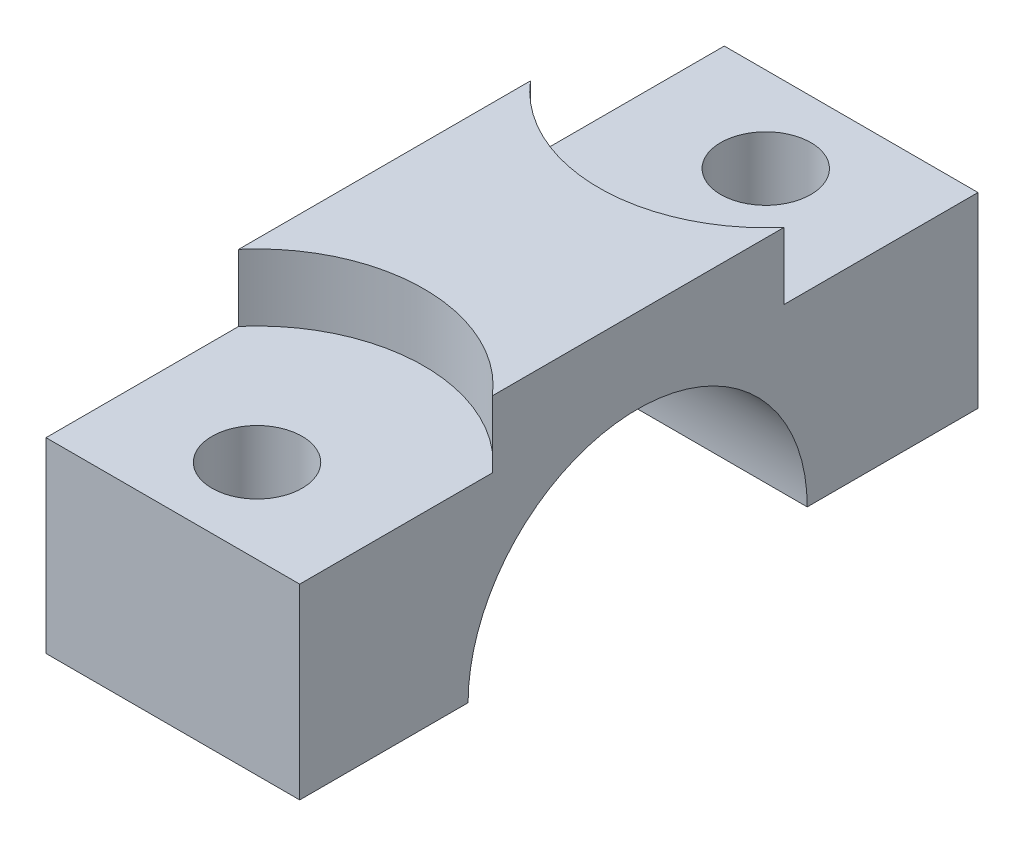
ISO-10303-21;
HEADER;
FILE_DESCRIPTION(('STEP AP214'),'2;1');
FILE_NAME('part.step','',(''),(''),'','','');
FILE_SCHEMA(('AUTOMOTIVE_DESIGN { 1 0 10303 214 1 1 1 1 }'));
ENDSEC;
DATA;
#1=APPLICATION_CONTEXT('core data for automotive mechanical design processes');
#2=APPLICATION_PROTOCOL_DEFINITION('international standard','automotive_design',2000,#1);
#3=PRODUCT_CONTEXT('',#1,'mechanical');
#4=PRODUCT('Part','Part','',(#3));
#5=PRODUCT_RELATED_PRODUCT_CATEGORY('part','',(#4));
#6=PRODUCT_DEFINITION_FORMATION('','',#4);
#7=PRODUCT_DEFINITION_CONTEXT('part definition',#1,'design');
#8=PRODUCT_DEFINITION('design','',#6,#7);
#9=PRODUCT_DEFINITION_SHAPE('','',#8);
#10=(LENGTH_UNIT() NAMED_UNIT(*) SI_UNIT(.MILLI.,.METRE.));
#11=(NAMED_UNIT(*) PLANE_ANGLE_UNIT() SI_UNIT($,.RADIAN.));
#12=(NAMED_UNIT(*) SI_UNIT($,.STERADIAN.) SOLID_ANGLE_UNIT());
#13=UNCERTAINTY_MEASURE_WITH_UNIT(LENGTH_MEASURE(1.E-05),#10,'distance_accuracy_value','');
#14=(GEOMETRIC_REPRESENTATION_CONTEXT(3) GLOBAL_UNCERTAINTY_ASSIGNED_CONTEXT((#13)) GLOBAL_UNIT_ASSIGNED_CONTEXT((#10,
#11,#12)) REPRESENTATION_CONTEXT('',''));
#15=CARTESIAN_POINT('',(0.,0.,0.));
#16=DIRECTION('',(0.,0.,1.));
#17=DIRECTION('',(1.,0.,0.));
#18=AXIS2_PLACEMENT_3D('',#15,#16,#17);
#19=CARTESIAN_POINT('',(19.,0.,0.));
#20=DIRECTION('',(-1.,0.,0.));
#21=DIRECTION('',(0.,0.,1.));
#22=AXIS2_PLACEMENT_3D('',#19,#20,#21);
#23=CYLINDRICAL_SURFACE('',#22,12.7);
#24=CARTESIAN_POINT('',(0.,0.,0.));
#25=DIRECTION('',(1.,0.,0.));
#26=DIRECTION('',(0.,0.,-1.));
#27=AXIS2_PLACEMENT_3D('',#24,#25,#26);
#28=CIRCLE('',#27,12.7);
#29=CARTESIAN_POINT('',(0.,0.,-12.7));
#30=VERTEX_POINT('',#29);
#31=CARTESIAN_POINT('',(0.,0.,12.7));
#32=VERTEX_POINT('',#31);
#33=EDGE_CURVE('E164',#30,#32,#28,.T.);
#34=ORIENTED_EDGE('',*,*,#33,.F.);
#35=DIRECTION('',(-1.,0.,0.));
#36=VECTOR('',#35,1.);
#37=CARTESIAN_POINT('',(19.,0.,-12.7));
#38=LINE('',#37,#36);
#39=CARTESIAN_POINT('',(19.,0.,-12.7));
#40=VERTEX_POINT('',#39);
#41=EDGE_CURVE('E211',#40,#30,#38,.T.);
#42=ORIENTED_EDGE('',*,*,#41,.F.);
#43=CARTESIAN_POINT('',(19.,0.,0.));
#44=DIRECTION('',(1.,0.,0.));
#45=DIRECTION('',(0.,0.,-1.));
#46=AXIS2_PLACEMENT_3D('',#43,#44,#45);
#47=CIRCLE('',#46,12.7);
#48=CARTESIAN_POINT('',(19.,0.,12.7));
#49=VERTEX_POINT('',#48);
#50=EDGE_CURVE('E165',#40,#49,#47,.T.);
#51=ORIENTED_EDGE('',*,*,#50,.T.);
#52=DIRECTION('',(-1.,0.,0.));
#53=VECTOR('',#52,1.);
#54=CARTESIAN_POINT('',(19.,0.,12.7));
#55=LINE('',#54,#53);
#56=EDGE_CURVE('E201',#49,#32,#55,.T.);
#57=ORIENTED_EDGE('',*,*,#56,.T.);
#58=EDGE_LOOP('',(#34,#42,#51,#57));
#59=FACE_BOUND('',#58,.T.);
#60=ADVANCED_FACE('F39',(#59),#23,.F.);
#61=CARTESIAN_POINT('',(19.,0.,0.));
#62=DIRECTION('',(0.,1.,0.));
#63=DIRECTION('',(0.,0.,1.));
#64=AXIS2_PLACEMENT_3D('',#61,#62,#63);
#65=PLANE('',#64);
#66=CARTESIAN_POINT('',(9.5,0.,-19.0947193806724));
#67=DIRECTION('',(0.,1.,0.));
#68=DIRECTION('',(0.,0.,1.));
#69=AXIS2_PLACEMENT_3D('',#66,#67,#68);
#70=CIRCLE('',#69,3.375);
#71=CARTESIAN_POINT('',(9.5,0.,-15.7197193806724));
#72=VERTEX_POINT('',#71);
#73=EDGE_CURVE('E226',#72,#72,#70,.T.);
#74=ORIENTED_EDGE('',*,*,#73,.T.);
#75=EDGE_LOOP('',(#74));
#76=FACE_BOUND('',#75,.T.);
#77=DIRECTION('',(0.,0.,-1.));
#78=VECTOR('',#77,1.);
#79=CARTESIAN_POINT('',(0.,0.,0.));
#80=LINE('',#79,#78);
#81=CARTESIAN_POINT('',(0.,0.,-25.4894387613447));
#82=VERTEX_POINT('',#81);
#83=EDGE_CURVE('E189',#30,#82,#80,.T.);
#84=ORIENTED_EDGE('',*,*,#83,.T.);
#85=DIRECTION('',(-1.,0.,0.));
#86=VECTOR('',#85,1.);
#87=CARTESIAN_POINT('',(19.,0.,-25.4894387613447));
#88=LINE('',#87,#86);
#89=CARTESIAN_POINT('',(19.,0.,-25.4894387613447));
#90=VERTEX_POINT('',#89);
#91=EDGE_CURVE('E207',#90,#82,#88,.T.);
#92=ORIENTED_EDGE('',*,*,#91,.F.);
#93=DIRECTION('',(0.,0.,-1.));
#94=VECTOR('',#93,1.);
#95=CARTESIAN_POINT('',(19.,0.,0.));
#96=LINE('',#95,#94);
#97=EDGE_CURVE('E169',#40,#90,#96,.T.);
#98=ORIENTED_EDGE('',*,*,#97,.F.);
#99=ORIENTED_EDGE('',*,*,#41,.T.);
#100=EDGE_LOOP('',(#84,#92,#98,#99));
#101=FACE_BOUND('',#100,.T.);
#102=ADVANCED_FACE('F232',(#76,#101),#65,.F.);
#103=CARTESIAN_POINT('',(19.,0.,-25.4894387613447));
#104=DIRECTION('',(0.,0.,1.));
#105=DIRECTION('',(1.,0.,0.));
#106=AXIS2_PLACEMENT_3D('',#103,#104,#105);
#107=PLANE('',#106);
#108=DIRECTION('',(0.,1.,0.));
#109=VECTOR('',#108,1.);
#110=CARTESIAN_POINT('',(0.,0.,-25.4894387613447));
#111=LINE('',#110,#109);
#112=CARTESIAN_POINT('',(0.,14.,-25.4894387613447));
#113=VERTEX_POINT('',#112);
#114=EDGE_CURVE('E192',#82,#113,#111,.T.);
#115=ORIENTED_EDGE('',*,*,#114,.T.);
#116=DIRECTION('',(1.,0.,0.));
#117=VECTOR('',#116,1.);
#118=CARTESIAN_POINT('',(19.,14.,-25.4894387613447));
#119=LINE('',#118,#117);
#120=CARTESIAN_POINT('',(19.,14.,-25.4894387613447));
#121=VERTEX_POINT('',#120);
#122=EDGE_CURVE('E116',#113,#121,#119,.T.);
#123=ORIENTED_EDGE('',*,*,#122,.T.);
#124=DIRECTION('',(0.,1.,0.));
#125=VECTOR('',#124,1.);
#126=CARTESIAN_POINT('',(19.,0.,-25.4894387613447));
#127=LINE('',#126,#125);
#128=EDGE_CURVE('E173',#90,#121,#127,.T.);
#129=ORIENTED_EDGE('',*,*,#128,.F.);
#130=ORIENTED_EDGE('',*,*,#91,.T.);
#131=EDGE_LOOP('',(#115,#123,#129,#130));
#132=FACE_BOUND('',#131,.T.);
#133=ADVANCED_FACE('F224',(#132),#107,.F.);
#134=CARTESIAN_POINT('',(19.,19.,0.));
#135=DIRECTION('',(0.,1.,0.));
#136=DIRECTION('',(0.,0.,1.));
#137=AXIS2_PLACEMENT_3D('',#134,#135,#136);
#138=PLANE('',#137);
#139=CARTESIAN_POINT('',(9.5,19.,-19.0947193806724));
#140=DIRECTION('',(0.,1.,0.));
#141=DIRECTION('',(0.,0.,1.));
#142=AXIS2_PLACEMENT_3D('',#139,#140,#141);
#143=CIRCLE('',#142,12.5);
#144=CARTESIAN_POINT('',(0.,19.,-10.9706809760364));
#145=VERTEX_POINT('',#144);
#146=CARTESIAN_POINT('',(19.,19.,-10.9706809760364));
#147=VERTEX_POINT('',#146);
#148=EDGE_CURVE('E131',#145,#147,#143,.T.);
#149=ORIENTED_EDGE('',*,*,#148,.F.);
#150=DIRECTION('',(0.,0.,-1.));
#151=VECTOR('',#150,1.);
#152=CARTESIAN_POINT('',(0.,19.,0.));
#153=LINE('',#152,#151);
#154=CARTESIAN_POINT('',(0.,19.,10.8812422146917));
#155=VERTEX_POINT('',#154);
#156=EDGE_CURVE('E136',#155,#145,#153,.T.);
#157=ORIENTED_EDGE('',*,*,#156,.F.);
#158=CARTESIAN_POINT('',(9.5,19.,19.0052806193276));
#159=DIRECTION('',(0.,1.,0.));
#160=DIRECTION('',(0.,0.,1.));
#161=AXIS2_PLACEMENT_3D('',#158,#159,#160);
#162=CIRCLE('',#161,12.5);
#163=CARTESIAN_POINT('',(19.,19.,10.8812422146917));
#164=VERTEX_POINT('',#163);
#165=EDGE_CURVE('E61',#164,#155,#162,.T.);
#166=ORIENTED_EDGE('',*,*,#165,.F.);
#167=DIRECTION('',(0.,0.,-1.));
#168=VECTOR('',#167,1.);
#169=CARTESIAN_POINT('',(19.,19.,0.));
#170=LINE('',#169,#168);
#171=EDGE_CURVE('E178',#164,#147,#170,.T.);
#172=ORIENTED_EDGE('',*,*,#171,.T.);
#173=EDGE_LOOP('',(#149,#157,#166,#172));
#174=FACE_BOUND('',#173,.T.);
#175=ADVANCED_FACE('F258',(#174),#138,.T.);
#176=CARTESIAN_POINT('',(19.,0.,25.3105612386553));
#177=DIRECTION('',(0.,0.,1.));
#178=DIRECTION('',(1.,0.,0.));
#179=AXIS2_PLACEMENT_3D('',#176,#177,#178);
#180=PLANE('',#179);
#181=DIRECTION('',(1.,0.,0.));
#182=VECTOR('',#181,1.);
#183=CARTESIAN_POINT('',(19.,14.,25.3105612386553));
#184=LINE('',#183,#182);
#185=CARTESIAN_POINT('',(0.,14.,25.3105612386553));
#186=VERTEX_POINT('',#185);
#187=CARTESIAN_POINT('',(19.,14.,25.3105612386553));
#188=VERTEX_POINT('',#187);
#189=EDGE_CURVE('E158',#186,#188,#184,.T.);
#190=ORIENTED_EDGE('',*,*,#189,.F.);
#191=DIRECTION('',(0.,1.,0.));
#192=VECTOR('',#191,1.);
#193=CARTESIAN_POINT('',(0.,0.,25.3105612386553));
#194=LINE('',#193,#192);
#195=CARTESIAN_POINT('',(0.,0.,25.3105612386553));
#196=VERTEX_POINT('',#195);
#197=EDGE_CURVE('E197',#196,#186,#194,.T.);
#198=ORIENTED_EDGE('',*,*,#197,.F.);
#199=DIRECTION('',(-1.,0.,0.));
#200=VECTOR('',#199,1.);
#201=CARTESIAN_POINT('',(19.,0.,25.3105612386553));
#202=LINE('',#201,#200);
#203=CARTESIAN_POINT('',(19.,0.,25.3105612386553));
#204=VERTEX_POINT('',#203);
#205=EDGE_CURVE('E204',#204,#196,#202,.T.);
#206=ORIENTED_EDGE('',*,*,#205,.F.);
#207=DIRECTION('',(0.,1.,0.));
#208=VECTOR('',#207,1.);
#209=CARTESIAN_POINT('',(19.,0.,25.3105612386553));
#210=LINE('',#209,#208);
#211=EDGE_CURVE('E182',#204,#188,#210,.T.);
#212=ORIENTED_EDGE('',*,*,#211,.T.);
#213=EDGE_LOOP('',(#190,#198,#206,#212));
#214=FACE_BOUND('',#213,.T.);
#215=ADVANCED_FACE('F250',(#214),#180,.T.);
#216=CARTESIAN_POINT('',(9.5,0.,19.0052806193276));
#217=DIRECTION('',(0.,1.,0.));
#218=DIRECTION('',(0.,0.,1.));
#219=AXIS2_PLACEMENT_3D('',#216,#217,#218);
#220=CIRCLE('',#219,3.375);
#221=CARTESIAN_POINT('',(9.5,0.,22.3802806193276));
#222=VERTEX_POINT('',#221);
#223=EDGE_CURVE('E151',#222,#222,#220,.T.);
#224=ORIENTED_EDGE('',*,*,#223,.T.);
#225=EDGE_LOOP('',(#224));
#226=FACE_BOUND('',#225,.T.);
#227=EDGE_CURVE('E170',#196,#32,#80,.T.);
#228=ORIENTED_EDGE('',*,*,#227,.T.);
#229=ORIENTED_EDGE('',*,*,#56,.F.);
#230=EDGE_CURVE('E174',#204,#49,#96,.T.);
#231=ORIENTED_EDGE('',*,*,#230,.F.);
#232=ORIENTED_EDGE('',*,*,#205,.T.);
#233=EDGE_LOOP('',(#228,#229,#231,#232));
#234=FACE_BOUND('',#233,.T.);
#235=ADVANCED_FACE('F241',(#226,#234),#65,.F.);
#236=CARTESIAN_POINT('',(19.,0.,0.));
#237=DIRECTION('',(1.,0.,0.));
#238=DIRECTION('',(0.,0.,-1.));
#239=AXIS2_PLACEMENT_3D('',#236,#237,#238);
#240=PLANE('',#239);
#241=DIRECTION('',(0.,1.,0.));
#242=VECTOR('',#241,1.);
#243=CARTESIAN_POINT('',(19.,19.,-10.9706809760364));
#244=LINE('',#243,#242);
#245=CARTESIAN_POINT('',(19.,14.,-10.9706809760364));
#246=VERTEX_POINT('',#245);
#247=EDGE_CURVE('E11',#147,#246,#244,.F.);
#248=ORIENTED_EDGE('',*,*,#247,.F.);
#249=ORIENTED_EDGE('',*,*,#171,.F.);
#250=DIRECTION('',(0.,1.,0.));
#251=VECTOR('',#250,1.);
#252=CARTESIAN_POINT('',(19.,19.,10.8812422146917));
#253=LINE('',#252,#251);
#254=CARTESIAN_POINT('',(19.,14.,10.8812422146917));
#255=VERTEX_POINT('',#254);
#256=EDGE_CURVE('E155',#255,#164,#253,.T.);
#257=ORIENTED_EDGE('',*,*,#256,.F.);
#258=DIRECTION('',(0.,0.,-1.));
#259=VECTOR('',#258,1.);
#260=CARTESIAN_POINT('',(19.,14.,0.));
#261=LINE('',#260,#259);
#262=EDGE_CURVE('E161',#188,#255,#261,.T.);
#263=ORIENTED_EDGE('',*,*,#262,.F.);
#264=ORIENTED_EDGE('',*,*,#211,.F.);
#265=ORIENTED_EDGE('',*,*,#230,.T.);
#266=ORIENTED_EDGE('',*,*,#50,.F.);
#267=ORIENTED_EDGE('',*,*,#97,.T.);
#268=ORIENTED_EDGE('',*,*,#128,.T.);
#269=DIRECTION('',(0.,0.,-1.));
#270=VECTOR('',#269,1.);
#271=CARTESIAN_POINT('',(19.,14.,0.));
#272=LINE('',#271,#270);
#273=EDGE_CURVE('E47',#246,#121,#272,.T.);
#274=ORIENTED_EDGE('',*,*,#273,.F.);
#275=EDGE_LOOP('',(#248,#249,#257,#263,#264,#265,#266,#267,#268,#274));
#276=FACE_BOUND('',#275,.T.);
#277=ADVANCED_FACE('F227',(#276),#240,.T.);
#278=CARTESIAN_POINT('',(0.,0.,0.));
#279=DIRECTION('',(1.,0.,0.));
#280=DIRECTION('',(0.,0.,-1.));
#281=AXIS2_PLACEMENT_3D('',#278,#279,#280);
#282=PLANE('',#281);
#283=DIRECTION('',(0.,1.,0.));
#284=VECTOR('',#283,1.);
#285=CARTESIAN_POINT('',(0.,19.,-10.9706809760364));
#286=LINE('',#285,#284);
#287=CARTESIAN_POINT('',(0.,14.,-10.9706809760364));
#288=VERTEX_POINT('',#287);
#289=EDGE_CURVE('E122',#145,#288,#286,.F.);
#290=ORIENTED_EDGE('',*,*,#289,.T.);
#291=DIRECTION('',(0.,0.,-1.));
#292=VECTOR('',#291,1.);
#293=CARTESIAN_POINT('',(0.,14.,0.));
#294=LINE('',#293,#292);
#295=EDGE_CURVE('E113',#288,#113,#294,.T.);
#296=ORIENTED_EDGE('',*,*,#295,.T.);
#297=ORIENTED_EDGE('',*,*,#114,.F.);
#298=ORIENTED_EDGE('',*,*,#83,.F.);
#299=ORIENTED_EDGE('',*,*,#33,.T.);
#300=ORIENTED_EDGE('',*,*,#227,.F.);
#301=ORIENTED_EDGE('',*,*,#197,.T.);
#302=DIRECTION('',(0.,0.,-1.));
#303=VECTOR('',#302,1.);
#304=CARTESIAN_POINT('',(0.,14.,0.));
#305=LINE('',#304,#303);
#306=CARTESIAN_POINT('',(0.,14.,10.8812422146917));
#307=VERTEX_POINT('',#306);
#308=EDGE_CURVE('E217',#186,#307,#305,.T.);
#309=ORIENTED_EDGE('',*,*,#308,.T.);
#310=DIRECTION('',(0.,1.,0.));
#311=VECTOR('',#310,1.);
#312=CARTESIAN_POINT('',(0.,19.,10.8812422146917));
#313=LINE('',#312,#311);
#314=EDGE_CURVE('E214',#307,#155,#313,.T.);
#315=ORIENTED_EDGE('',*,*,#314,.T.);
#316=ORIENTED_EDGE('',*,*,#156,.T.);
#317=EDGE_LOOP('',(#290,#296,#297,#298,#299,#300,#301,#309,#315,#316));
#318=FACE_BOUND('',#317,.T.);
#319=ADVANCED_FACE('F134',(#318),#282,.F.);
#320=CARTESIAN_POINT('',(9.5,19.,19.0052806193276));
#321=DIRECTION('',(0.,1.,0.));
#322=DIRECTION('',(0.,0.,1.));
#323=AXIS2_PLACEMENT_3D('',#320,#321,#322);
#324=CYLINDRICAL_SURFACE('',#323,3.375);
#325=ORIENTED_EDGE('',*,*,#223,.F.);
#326=EDGE_LOOP('',(#325));
#327=FACE_BOUND('',#326,.T.);
#328=CARTESIAN_POINT('',(9.5,14.,19.0052806193276));
#329=DIRECTION('',(0.,1.,0.));
#330=DIRECTION('',(0.,0.,1.));
#331=AXIS2_PLACEMENT_3D('',#328,#329,#330);
#332=CIRCLE('',#331,3.375);
#333=CARTESIAN_POINT('',(9.5,14.,22.3802806193276));
#334=VERTEX_POINT('',#333);
#335=EDGE_CURVE('E147',#334,#334,#332,.T.);
#336=ORIENTED_EDGE('',*,*,#335,.T.);
#337=EDGE_LOOP('',(#336));
#338=FACE_BOUND('',#337,.T.);
#339=ADVANCED_FACE('F301',(#327,#338),#324,.F.);
#340=CARTESIAN_POINT('',(12.875,14.,19.0052806193276));
#341=DIRECTION('',(0.,-1.,0.));
#342=DIRECTION('',(0.,0.,-1.));
#343=AXIS2_PLACEMENT_3D('',#340,#341,#342);
#344=PLANE('',#343);
#345=ORIENTED_EDGE('',*,*,#262,.T.);
#346=CARTESIAN_POINT('',(9.5,14.,19.0052806193276));
#347=DIRECTION('',(0.,1.,0.));
#348=DIRECTION('',(0.,0.,1.));
#349=AXIS2_PLACEMENT_3D('',#346,#347,#348);
#350=CIRCLE('',#349,12.5);
#351=EDGE_CURVE('E140',#255,#307,#350,.T.);
#352=ORIENTED_EDGE('',*,*,#351,.T.);
#353=ORIENTED_EDGE('',*,*,#308,.F.);
#354=ORIENTED_EDGE('',*,*,#189,.T.);
#355=EDGE_LOOP('',(#345,#352,#353,#354));
#356=FACE_BOUND('',#355,.T.);
#357=ORIENTED_EDGE('',*,*,#335,.F.);
#358=EDGE_LOOP('',(#357));
#359=FACE_BOUND('',#358,.T.);
#360=ADVANCED_FACE('F252',(#356,#359),#344,.F.);
#361=CARTESIAN_POINT('',(9.5,19.,19.0052806193276));
#362=DIRECTION('',(0.,1.,0.));
#363=DIRECTION('',(0.,0.,1.));
#364=AXIS2_PLACEMENT_3D('',#361,#362,#363);
#365=CYLINDRICAL_SURFACE('',#364,12.5);
#366=ORIENTED_EDGE('',*,*,#256,.T.);
#367=ORIENTED_EDGE('',*,*,#165,.T.);
#368=ORIENTED_EDGE('',*,*,#314,.F.);
#369=ORIENTED_EDGE('',*,*,#351,.F.);
#370=EDGE_LOOP('',(#366,#367,#368,#369));
#371=FACE_BOUND('',#370,.T.);
#372=ADVANCED_FACE('F255',(#371),#365,.F.);
#373=CARTESIAN_POINT('',(9.5,19.,-19.0947193806724));
#374=DIRECTION('',(0.,1.,0.));
#375=DIRECTION('',(0.,0.,1.));
#376=AXIS2_PLACEMENT_3D('',#373,#374,#375);
#377=CYLINDRICAL_SURFACE('',#376,12.5);
#378=ORIENTED_EDGE('',*,*,#148,.T.);
#379=ORIENTED_EDGE('',*,*,#247,.T.);
#380=CARTESIAN_POINT('',(9.5,14.,-19.0947193806724));
#381=DIRECTION('',(0.,1.,0.));
#382=DIRECTION('',(0.,0.,1.));
#383=AXIS2_PLACEMENT_3D('',#380,#381,#382);
#384=CIRCLE('',#383,12.5);
#385=EDGE_CURVE('E54',#288,#246,#384,.T.);
#386=ORIENTED_EDGE('',*,*,#385,.F.);
#387=ORIENTED_EDGE('',*,*,#289,.F.);
#388=EDGE_LOOP('',(#378,#379,#386,#387));
#389=FACE_BOUND('',#388,.T.);
#390=ADVANCED_FACE('F125',(#389),#377,.F.);
#391=CARTESIAN_POINT('',(12.875,14.,-19.0947193806724));
#392=DIRECTION('',(0.,-1.,0.));
#393=DIRECTION('',(0.,0.,-1.));
#394=AXIS2_PLACEMENT_3D('',#391,#392,#393);
#395=PLANE('',#394);
#396=CARTESIAN_POINT('',(9.5,14.,-19.0947193806724));
#397=DIRECTION('',(0.,1.,0.));
#398=DIRECTION('',(0.,0.,1.));
#399=AXIS2_PLACEMENT_3D('',#396,#397,#398);
#400=CIRCLE('',#399,3.375);
#401=CARTESIAN_POINT('',(9.5,14.,-15.7197193806723));
#402=VERTEX_POINT('',#401);
#403=EDGE_CURVE('E130',#402,#402,#400,.T.);
#404=ORIENTED_EDGE('',*,*,#403,.F.);
#405=EDGE_LOOP('',(#404));
#406=FACE_BOUND('',#405,.T.);
#407=ORIENTED_EDGE('',*,*,#385,.T.);
#408=ORIENTED_EDGE('',*,*,#273,.T.);
#409=ORIENTED_EDGE('',*,*,#122,.F.);
#410=ORIENTED_EDGE('',*,*,#295,.F.);
#411=EDGE_LOOP('',(#407,#408,#409,#410));
#412=FACE_BOUND('',#411,.T.);
#413=ADVANCED_FACE('F114',(#406,#412),#395,.F.);
#414=CARTESIAN_POINT('',(9.5,19.,-19.0947193806724));
#415=DIRECTION('',(0.,1.,0.));
#416=DIRECTION('',(0.,0.,1.));
#417=AXIS2_PLACEMENT_3D('',#414,#415,#416);
#418=CYLINDRICAL_SURFACE('',#417,3.375);
#419=ORIENTED_EDGE('',*,*,#73,.F.);
#420=EDGE_LOOP('',(#419));
#421=FACE_BOUND('',#420,.T.);
#422=ORIENTED_EDGE('',*,*,#403,.T.);
#423=EDGE_LOOP('',(#422));
#424=FACE_BOUND('',#423,.T.);
#425=ADVANCED_FACE('F270',(#421,#424),#418,.F.);
#426=CLOSED_SHELL('',(#60,#102,#133,#175,#215,#235,#277,#319,#339,#360,#372,#390,#413,#425));
#427=MANIFOLD_SOLID_BREP('B2',#426);
#428=ADVANCED_BREP_SHAPE_REPRESENTATION('',(#18,#427),#14);
#429=SHAPE_DEFINITION_REPRESENTATION(#9,#428);
ENDSEC;
END-ISO-10303-21;
